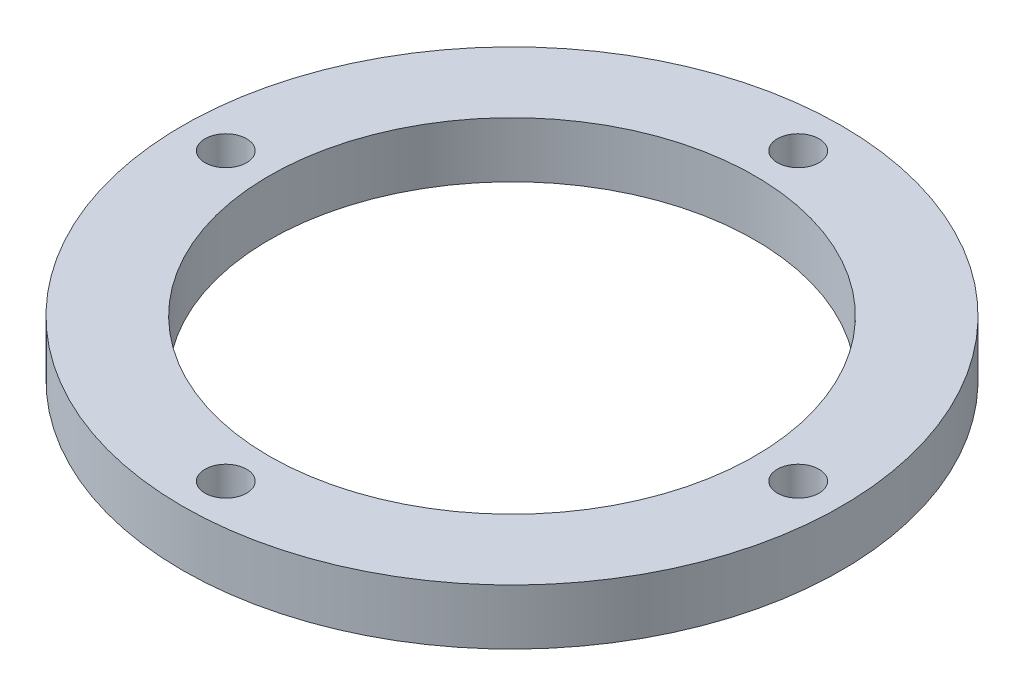
ISO-10303-21;
HEADER;
FILE_DESCRIPTION(('STEP AP214'),'2;1');
FILE_NAME('part.step','',(''),(''),'','','');
FILE_SCHEMA(('AUTOMOTIVE_DESIGN { 1 0 10303 214 1 1 1 1 }'));
ENDSEC;
DATA;
#1=APPLICATION_CONTEXT('core data for automotive mechanical design processes');
#2=APPLICATION_PROTOCOL_DEFINITION('international standard','automotive_design',2000,#1);
#3=PRODUCT_CONTEXT('',#1,'mechanical');
#4=PRODUCT('Part','Part','',(#3));
#5=PRODUCT_RELATED_PRODUCT_CATEGORY('part','',(#4));
#6=PRODUCT_DEFINITION_FORMATION('','',#4);
#7=PRODUCT_DEFINITION_CONTEXT('part definition',#1,'design');
#8=PRODUCT_DEFINITION('design','',#6,#7);
#9=PRODUCT_DEFINITION_SHAPE('','',#8);
#10=(LENGTH_UNIT() NAMED_UNIT(*) SI_UNIT(.MILLI.,.METRE.));
#11=(NAMED_UNIT(*) PLANE_ANGLE_UNIT() SI_UNIT($,.RADIAN.));
#12=(NAMED_UNIT(*) SI_UNIT($,.STERADIAN.) SOLID_ANGLE_UNIT());
#13=UNCERTAINTY_MEASURE_WITH_UNIT(LENGTH_MEASURE(1.E-05),#10,'distance_accuracy_value','');
#14=(GEOMETRIC_REPRESENTATION_CONTEXT(3) GLOBAL_UNCERTAINTY_ASSIGNED_CONTEXT((#13)) GLOBAL_UNIT_ASSIGNED_CONTEXT((#10,
#11,#12)) REPRESENTATION_CONTEXT('',''));
#15=CARTESIAN_POINT('',(0.,0.,0.));
#16=DIRECTION('',(0.,0.,1.));
#17=DIRECTION('',(1.,0.,0.));
#18=AXIS2_PLACEMENT_3D('',#15,#16,#17);
#19=CARTESIAN_POINT('',(0.,8.,0.));
#20=DIRECTION('',(0.,1.,0.));
#21=DIRECTION('',(0.,0.,1.));
#22=AXIS2_PLACEMENT_3D('',#19,#20,#21);
#23=PLANE('',#22);
#24=CARTESIAN_POINT('',(-41.25,8.,-2.88047210454558E-13));
#25=DIRECTION('',(0.,1.,0.));
#26=DIRECTION('',(0.,0.,1.));
#27=AXIS2_PLACEMENT_3D('',#24,#25,#26);
#28=CIRCLE('',#27,3.);
#29=CARTESIAN_POINT('',(-41.25,8.,2.99999999999971));
#30=VERTEX_POINT('',#29);
#31=EDGE_CURVE('E61',#30,#30,#28,.T.);
#32=ORIENTED_EDGE('',*,*,#31,.F.);
#33=EDGE_LOOP('',(#32));
#34=FACE_BOUND('',#33,.T.);
#35=CARTESIAN_POINT('',(41.25,8.,0.));
#36=DIRECTION('',(0.,1.,0.));
#37=DIRECTION('',(0.,0.,1.));
#38=AXIS2_PLACEMENT_3D('',#35,#36,#37);
#39=CIRCLE('',#38,3.);
#40=CARTESIAN_POINT('',(41.25,8.,3.));
#41=VERTEX_POINT('',#40);
#42=EDGE_CURVE('E49',#41,#41,#39,.T.);
#43=ORIENTED_EDGE('',*,*,#42,.F.);
#44=EDGE_LOOP('',(#43));
#45=FACE_BOUND('',#44,.T.);
#46=CARTESIAN_POINT('',(0.,8.,0.));
#47=DIRECTION('',(0.,1.,0.));
#48=DIRECTION('',(0.,0.,1.));
#49=AXIS2_PLACEMENT_3D('',#46,#47,#48);
#50=CIRCLE('',#49,47.5);
#51=CARTESIAN_POINT('',(0.,8.,47.5));
#52=VERTEX_POINT('',#51);
#53=EDGE_CURVE('E10',#52,#52,#50,.T.);
#54=ORIENTED_EDGE('',*,*,#53,.T.);
#55=EDGE_LOOP('',(#54));
#56=FACE_BOUND('',#55,.T.);
#57=CARTESIAN_POINT('',(0.,8.,0.));
#58=DIRECTION('',(0.,1.,0.));
#59=DIRECTION('',(0.,0.,1.));
#60=AXIS2_PLACEMENT_3D('',#57,#58,#59);
#61=CIRCLE('',#60,35.);
#62=CARTESIAN_POINT('',(0.,8.,35.));
#63=VERTEX_POINT('',#62);
#64=EDGE_CURVE('E44',#63,#63,#61,.T.);
#65=ORIENTED_EDGE('',*,*,#64,.F.);
#66=EDGE_LOOP('',(#65));
#67=FACE_BOUND('',#66,.T.);
#68=CARTESIAN_POINT('',(-1.44023605227279E-13,8.,41.25));
#69=DIRECTION('',(0.,1.,0.));
#70=DIRECTION('',(0.,0.,1.));
#71=AXIS2_PLACEMENT_3D('',#68,#69,#70);
#72=CIRCLE('',#71,3.);
#73=CARTESIAN_POINT('',(-1.44023605227279E-13,8.,44.25));
#74=VERTEX_POINT('',#73);
#75=EDGE_CURVE('E55',#74,#74,#72,.T.);
#76=ORIENTED_EDGE('',*,*,#75,.F.);
#77=EDGE_LOOP('',(#76));
#78=FACE_BOUND('',#77,.T.);
#79=CARTESIAN_POINT('',(4.32070815681838E-13,8.,-41.25));
#80=DIRECTION('',(0.,1.,0.));
#81=DIRECTION('',(0.,0.,1.));
#82=AXIS2_PLACEMENT_3D('',#79,#80,#81);
#83=CIRCLE('',#82,3.);
#84=CARTESIAN_POINT('',(4.32070815681838E-13,8.,-38.25));
#85=VERTEX_POINT('',#84);
#86=EDGE_CURVE('E67',#85,#85,#83,.T.);
#87=ORIENTED_EDGE('',*,*,#86,.F.);
#88=EDGE_LOOP('',(#87));
#89=FACE_BOUND('',#88,.T.);
#90=ADVANCED_FACE('F33',(#34,#45,#56,#67,#78,#89),#23,.T.);
#91=CARTESIAN_POINT('',(0.,0.,0.));
#92=DIRECTION('',(0.,1.,0.));
#93=DIRECTION('',(0.,0.,1.));
#94=AXIS2_PLACEMENT_3D('',#91,#92,#93);
#95=PLANE('',#94);
#96=CARTESIAN_POINT('',(0.,0.,0.));
#97=DIRECTION('',(0.,1.,0.));
#98=DIRECTION('',(0.,0.,1.));
#99=AXIS2_PLACEMENT_3D('',#96,#97,#98);
#100=CIRCLE('',#99,47.5);
#101=CARTESIAN_POINT('',(0.,0.,47.5));
#102=VERTEX_POINT('',#101);
#103=EDGE_CURVE('E37',#102,#102,#100,.T.);
#104=ORIENTED_EDGE('',*,*,#103,.F.);
#105=EDGE_LOOP('',(#104));
#106=FACE_BOUND('',#105,.T.);
#107=CARTESIAN_POINT('',(0.,0.,0.));
#108=DIRECTION('',(0.,1.,0.));
#109=DIRECTION('',(0.,0.,1.));
#110=AXIS2_PLACEMENT_3D('',#107,#108,#109);
#111=CIRCLE('',#110,35.);
#112=CARTESIAN_POINT('',(0.,0.,35.));
#113=VERTEX_POINT('',#112);
#114=EDGE_CURVE('E46',#113,#113,#111,.T.);
#115=ORIENTED_EDGE('',*,*,#114,.T.);
#116=EDGE_LOOP('',(#115));
#117=FACE_BOUND('',#116,.T.);
#118=CARTESIAN_POINT('',(41.25,0.,0.));
#119=DIRECTION('',(0.,1.,0.));
#120=DIRECTION('',(0.,0.,1.));
#121=AXIS2_PLACEMENT_3D('',#118,#119,#120);
#122=CIRCLE('',#121,3.);
#123=CARTESIAN_POINT('',(41.25,0.,3.));
#124=VERTEX_POINT('',#123);
#125=EDGE_CURVE('E52',#124,#124,#122,.T.);
#126=ORIENTED_EDGE('',*,*,#125,.T.);
#127=EDGE_LOOP('',(#126));
#128=FACE_BOUND('',#127,.T.);
#129=CARTESIAN_POINT('',(-1.44023605227279E-13,0.,41.25));
#130=DIRECTION('',(0.,1.,0.));
#131=DIRECTION('',(0.,0.,1.));
#132=AXIS2_PLACEMENT_3D('',#129,#130,#131);
#133=CIRCLE('',#132,3.);
#134=CARTESIAN_POINT('',(-1.44023605227279E-13,0.,44.25));
#135=VERTEX_POINT('',#134);
#136=EDGE_CURVE('E58',#135,#135,#133,.T.);
#137=ORIENTED_EDGE('',*,*,#136,.T.);
#138=EDGE_LOOP('',(#137));
#139=FACE_BOUND('',#138,.T.);
#140=CARTESIAN_POINT('',(-41.25,0.,-2.88047210454558E-13));
#141=DIRECTION('',(0.,1.,0.));
#142=DIRECTION('',(0.,0.,1.));
#143=AXIS2_PLACEMENT_3D('',#140,#141,#142);
#144=CIRCLE('',#143,3.);
#145=CARTESIAN_POINT('',(-41.25,0.,2.99999999999971));
#146=VERTEX_POINT('',#145);
#147=EDGE_CURVE('E64',#146,#146,#144,.T.);
#148=ORIENTED_EDGE('',*,*,#147,.T.);
#149=EDGE_LOOP('',(#148));
#150=FACE_BOUND('',#149,.T.);
#151=CARTESIAN_POINT('',(4.32070815681838E-13,0.,-41.25));
#152=DIRECTION('',(0.,1.,0.));
#153=DIRECTION('',(0.,0.,1.));
#154=AXIS2_PLACEMENT_3D('',#151,#152,#153);
#155=CIRCLE('',#154,3.);
#156=CARTESIAN_POINT('',(4.32070815681838E-13,0.,-38.25));
#157=VERTEX_POINT('',#156);
#158=EDGE_CURVE('E70',#157,#157,#155,.T.);
#159=ORIENTED_EDGE('',*,*,#158,.T.);
#160=EDGE_LOOP('',(#159));
#161=FACE_BOUND('',#160,.T.);
#162=ADVANCED_FACE('F80',(#106,#117,#128,#139,#150,#161),#95,.F.);
#163=CARTESIAN_POINT('',(0.,8.,0.));
#164=DIRECTION('',(0.,-1.,0.));
#165=DIRECTION('',(0.,0.,-1.));
#166=AXIS2_PLACEMENT_3D('',#163,#164,#165);
#167=CYLINDRICAL_SURFACE('',#166,47.5);
#168=ORIENTED_EDGE('',*,*,#53,.F.);
#169=EDGE_LOOP('',(#168));
#170=FACE_BOUND('',#169,.T.);
#171=ORIENTED_EDGE('',*,*,#103,.T.);
#172=EDGE_LOOP('',(#171));
#173=FACE_BOUND('',#172,.T.);
#174=ADVANCED_FACE('F35',(#170,#173),#167,.T.);
#175=CARTESIAN_POINT('',(0.,8.,0.));
#176=DIRECTION('',(0.,-1.,0.));
#177=DIRECTION('',(0.,0.,-1.));
#178=AXIS2_PLACEMENT_3D('',#175,#176,#177);
#179=CYLINDRICAL_SURFACE('',#178,35.);
#180=ORIENTED_EDGE('',*,*,#64,.T.);
#181=EDGE_LOOP('',(#180));
#182=FACE_BOUND('',#181,.T.);
#183=ORIENTED_EDGE('',*,*,#114,.F.);
#184=EDGE_LOOP('',(#183));
#185=FACE_BOUND('',#184,.T.);
#186=ADVANCED_FACE('F90',(#182,#185),#179,.F.);
#187=CARTESIAN_POINT('',(41.25,8.,0.));
#188=DIRECTION('',(0.,-1.,0.));
#189=DIRECTION('',(0.,0.,-1.));
#190=AXIS2_PLACEMENT_3D('',#187,#188,#189);
#191=CYLINDRICAL_SURFACE('',#190,3.);
#192=ORIENTED_EDGE('',*,*,#42,.T.);
#193=EDGE_LOOP('',(#192));
#194=FACE_BOUND('',#193,.T.);
#195=ORIENTED_EDGE('',*,*,#125,.F.);
#196=EDGE_LOOP('',(#195));
#197=FACE_BOUND('',#196,.T.);
#198=ADVANCED_FACE('F93',(#194,#197),#191,.F.);
#199=CARTESIAN_POINT('',(-1.44023605227279E-13,8.,41.25));
#200=DIRECTION('',(0.,-1.,0.));
#201=DIRECTION('',(0.,0.,-1.));
#202=AXIS2_PLACEMENT_3D('',#199,#200,#201);
#203=CYLINDRICAL_SURFACE('',#202,3.);
#204=ORIENTED_EDGE('',*,*,#75,.T.);
#205=EDGE_LOOP('',(#204));
#206=FACE_BOUND('',#205,.T.);
#207=ORIENTED_EDGE('',*,*,#136,.F.);
#208=EDGE_LOOP('',(#207));
#209=FACE_BOUND('',#208,.T.);
#210=ADVANCED_FACE('F97',(#206,#209),#203,.F.);
#211=CARTESIAN_POINT('',(-41.25,8.,-2.88047210454558E-13));
#212=DIRECTION('',(0.,-1.,0.));
#213=DIRECTION('',(0.,0.,-1.));
#214=AXIS2_PLACEMENT_3D('',#211,#212,#213);
#215=CYLINDRICAL_SURFACE('',#214,3.);
#216=ORIENTED_EDGE('',*,*,#31,.T.);
#217=EDGE_LOOP('',(#216));
#218=FACE_BOUND('',#217,.T.);
#219=ORIENTED_EDGE('',*,*,#147,.F.);
#220=EDGE_LOOP('',(#219));
#221=FACE_BOUND('',#220,.T.);
#222=ADVANCED_FACE('F101',(#218,#221),#215,.F.);
#223=CARTESIAN_POINT('',(4.32070815681838E-13,8.,-41.25));
#224=DIRECTION('',(0.,-1.,0.));
#225=DIRECTION('',(0.,0.,-1.));
#226=AXIS2_PLACEMENT_3D('',#223,#224,#225);
#227=CYLINDRICAL_SURFACE('',#226,3.);
#228=ORIENTED_EDGE('',*,*,#86,.T.);
#229=EDGE_LOOP('',(#228));
#230=FACE_BOUND('',#229,.T.);
#231=ORIENTED_EDGE('',*,*,#158,.F.);
#232=EDGE_LOOP('',(#231));
#233=FACE_BOUND('',#232,.T.);
#234=ADVANCED_FACE('F76',(#230,#233),#227,.F.);
#235=CLOSED_SHELL('',(#90,#162,#174,#186,#198,#210,#222,#234));
#236=MANIFOLD_SOLID_BREP('B2',#235);
#237=ADVANCED_BREP_SHAPE_REPRESENTATION('',(#18,#236),#14);
#238=SHAPE_DEFINITION_REPRESENTATION(#9,#237);
ENDSEC;
END-ISO-10303-21;
